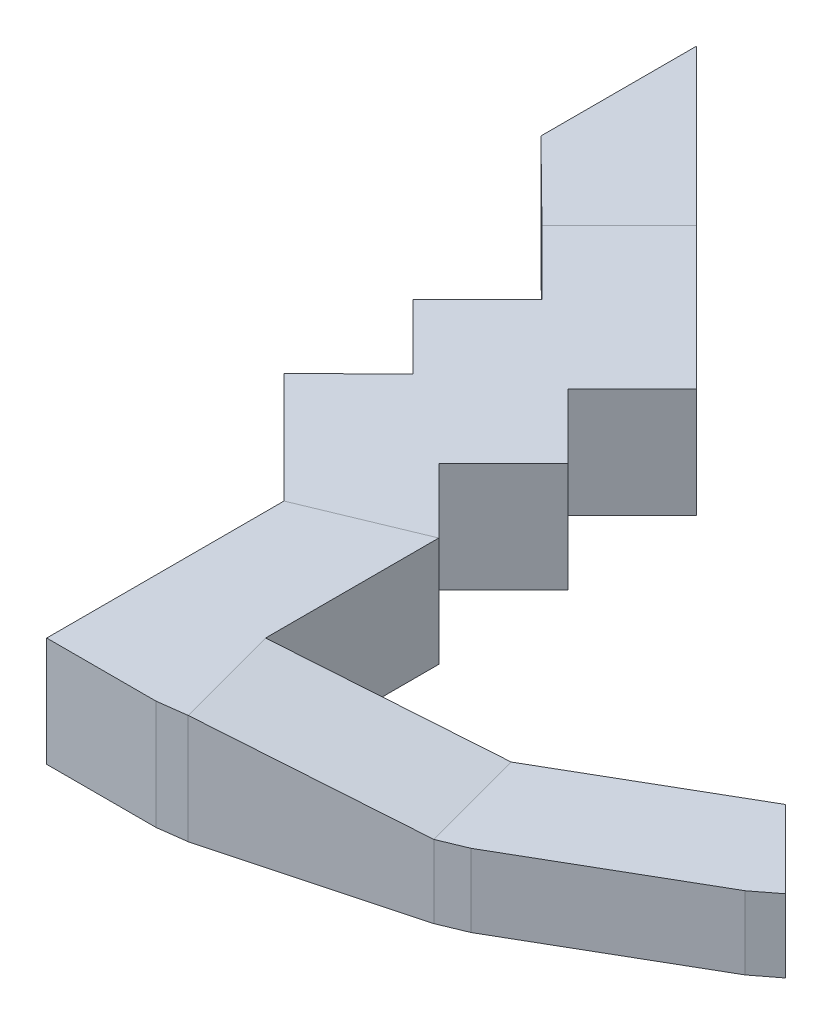
ISO-10303-21;
HEADER;
FILE_DESCRIPTION(('STEP AP214'),'2;1');
FILE_NAME('part.step','',(''),(''),'','','');
FILE_SCHEMA(('AUTOMOTIVE_DESIGN { 1 0 10303 214 1 1 1 1 }'));
ENDSEC;
DATA;
#1=APPLICATION_CONTEXT('core data for automotive mechanical design processes');
#2=APPLICATION_PROTOCOL_DEFINITION('international standard','automotive_design',2000,#1);
#3=PRODUCT_CONTEXT('',#1,'mechanical');
#4=PRODUCT('Part','Part','',(#3));
#5=PRODUCT_RELATED_PRODUCT_CATEGORY('part','',(#4));
#6=PRODUCT_DEFINITION_FORMATION('','',#4);
#7=PRODUCT_DEFINITION_CONTEXT('part definition',#1,'design');
#8=PRODUCT_DEFINITION('design','',#6,#7);
#9=PRODUCT_DEFINITION_SHAPE('','',#8);
#10=(LENGTH_UNIT() NAMED_UNIT(*) SI_UNIT(.MILLI.,.METRE.));
#11=(NAMED_UNIT(*) PLANE_ANGLE_UNIT() SI_UNIT($,.RADIAN.));
#12=(NAMED_UNIT(*) SI_UNIT($,.STERADIAN.) SOLID_ANGLE_UNIT());
#13=UNCERTAINTY_MEASURE_WITH_UNIT(LENGTH_MEASURE(1.E-05),#10,'distance_accuracy_value','');
#14=(GEOMETRIC_REPRESENTATION_CONTEXT(3) GLOBAL_UNCERTAINTY_ASSIGNED_CONTEXT((#13)) GLOBAL_UNIT_ASSIGNED_CONTEXT((#10,
#11,#12)) REPRESENTATION_CONTEXT('',''));
#15=CARTESIAN_POINT('',(0.,0.,0.));
#16=DIRECTION('',(0.,0.,1.));
#17=DIRECTION('',(1.,0.,0.));
#18=AXIS2_PLACEMENT_3D('',#15,#16,#17);
#19=CARTESIAN_POINT('',(-7369.52720002991,-600.,77.2236802050576));
#20=DIRECTION('',(0.707106781186546,0.,-0.707106781186549));
#21=DIRECTION('',(-0.707106781186549,0.,-0.707106781186546));
#22=AXIS2_PLACEMENT_3D('',#19,#20,#21);
#23=PLANE('',#22);
#24=DIRECTION('',(-0.707106781186546,0.,-0.707106781186549));
#25=VECTOR('',#24,1.);
#26=CARTESIAN_POINT('',(-7010.19169348406,-600.,436.55918675091));
#27=LINE('',#26,#25);
#28=CARTESIAN_POINT('',(-7010.19169348406,-600.,436.55918675091));
#29=VERTEX_POINT('',#28);
#30=CARTESIAN_POINT('',(-7788.00915278926,-600.,-341.258272554294));
#31=VERTEX_POINT('',#30);
#32=EDGE_CURVE('E321',#29,#31,#27,.T.);
#33=ORIENTED_EDGE('',*,*,#32,.T.);
#34=DIRECTION('',(0.,1.,0.));
#35=VECTOR('',#34,1.);
#36=CARTESIAN_POINT('',(-7788.00915278926,-600.,-341.258272554292));
#37=LINE('',#36,#35);
#38=CARTESIAN_POINT('',(-7788.00915278926,0.,-341.258272554292));
#39=VERTEX_POINT('',#38);
#40=EDGE_CURVE('E324',#31,#39,#37,.T.);
#41=ORIENTED_EDGE('',*,*,#40,.T.);
#42=DIRECTION('',(-0.707106781186549,0.,-0.707106781186546));
#43=VECTOR('',#42,1.);
#44=CARTESIAN_POINT('',(-7369.52720002991,0.,77.2236802050576));
#45=LINE('',#44,#43);
#46=CARTESIAN_POINT('',(-7010.19169348406,0.,436.55918675091));
#47=VERTEX_POINT('',#46);
#48=EDGE_CURVE('E293',#47,#39,#45,.T.);
#49=ORIENTED_EDGE('',*,*,#48,.F.);
#50=DIRECTION('',(0.,1.,0.));
#51=VECTOR('',#50,1.);
#52=CARTESIAN_POINT('',(-7010.19169348406,-600.,436.55918675091));
#53=LINE('',#52,#51);
#54=EDGE_CURVE('E257',#29,#47,#53,.T.);
#55=ORIENTED_EDGE('',*,*,#54,.F.);
#56=EDGE_LOOP('',(#33,#41,#49,#55));
#57=FACE_BOUND('',#56,.T.);
#58=ADVANCED_FACE('F38',(#57),#23,.T.);
#59=CARTESIAN_POINT('',(0.,0.,0.));
#60=DIRECTION('',(0.,1.,0.));
#61=DIRECTION('',(0.,0.,1.));
#62=AXIS2_PLACEMENT_3D('',#59,#60,#61);
#63=PLANE('',#62);
#64=DIRECTION('',(0.,0.,-1.));
#65=VECTOR('',#64,1.);
#66=CARTESIAN_POINT('',(-7010.19169348405,0.,2800.77274912401));
#67=LINE('',#66,#65);
#68=CARTESIAN_POINT('',(-7010.19169348405,0.,2800.77274912401));
#69=VERTEX_POINT('',#68);
#70=CARTESIAN_POINT('',(-7010.19169348406,0.,1850.77274912401));
#71=VERTEX_POINT('',#70);
#72=EDGE_CURVE('E239',#69,#71,#67,.T.);
#73=ORIENTED_EDGE('',*,*,#72,.T.);
#74=DIRECTION('',(-0.923622513371796,0.,0.383303343049296));
#75=VECTOR('',#74,1.);
#76=CARTESIAN_POINT('',(-374.722918828578,0.,-902.946792358019));
#77=LINE('',#76,#75);
#78=CARTESIAN_POINT('',(-7610.19169348406,0.,2099.77274912401));
#79=VERTEX_POINT('',#78);
#80=EDGE_CURVE('E422',#71,#79,#77,.T.);
#81=ORIENTED_EDGE('',*,*,#80,.T.);
#82=DIRECTION('',(0.,0.,1.));
#83=VECTOR('',#82,1.);
#84=CARTESIAN_POINT('',(-7610.19169348406,0.,3400.77274912401));
#85=LINE('',#84,#83);
#86=CARTESIAN_POINT('',(-7610.19169348406,0.,3400.77274912401));
#87=VERTEX_POINT('',#86);
#88=EDGE_CURVE('E429',#79,#87,#85,.T.);
#89=ORIENTED_EDGE('',*,*,#88,.T.);
#90=DIRECTION('',(1.,0.,0.));
#91=VECTOR('',#90,1.);
#92=CARTESIAN_POINT('',(-7010.19169348406,0.,3400.77274912401));
#93=LINE('',#92,#91);
#94=CARTESIAN_POINT('',(-7010.19169348406,0.,3400.77274912401));
#95=VERTEX_POINT('',#94);
#96=EDGE_CURVE('E427',#87,#95,#93,.T.);
#97=ORIENTED_EDGE('',*,*,#96,.T.);
#98=DIRECTION('',(0.99144486137381,0.,-0.130526192220058));
#99=VECTOR('',#98,1.);
#100=CARTESIAN_POINT('',(-7010.19169348406,0.,3400.77274912401));
#101=LINE('',#100,#99);
#102=CARTESIAN_POINT('',(-6854.90026642254,-1.196959198424E-13,3380.32824489744));
#103=VERTEX_POINT('',#102);
#104=EDGE_CURVE('E197',#95,#103,#101,.T.);
#105=ORIENTED_EDGE('',*,*,#104,.T.);
#106=DIRECTION('',(-0.258819045102514,0.,-0.96592582628907));
#107=VECTOR('',#106,1.);
#108=CARTESIAN_POINT('',(-3389.28468542171,0.,16314.1816726952));
#109=LINE('',#108,#107);
#110=EDGE_CURVE('E391',#103,#69,#109,.T.);
#111=ORIENTED_EDGE('',*,*,#110,.T.);
#112=EDGE_LOOP('',(#73,#81,#89,#97,#105,#111));
#113=FACE_BOUND('',#112,.T.);
#114=ADVANCED_FACE('F423',(#113),#63,.T.);
#115=DIRECTION('',(-0.711924819814183,0.,-0.702255687718186));
#116=VECTOR('',#115,1.);
#117=CARTESIAN_POINT('',(-4091.48873489222,0.,4147.82312383182));
#118=LINE('',#117,#116);
#119=CARTESIAN_POINT('',(-8212.27322150119,0.,83.0057961576385));
#120=VERTEX_POINT('',#119);
#121=CARTESIAN_POINT('',(-8639.44310705767,0.,-338.362406502111));
#122=VERTEX_POINT('',#121);
#123=EDGE_CURVE('E249',#120,#122,#118,.T.);
#124=ORIENTED_EDGE('',*,*,#123,.F.);
#125=DIRECTION('',(0.707106781186545,0.,-0.70710678118655));
#126=VECTOR('',#125,1.);
#127=CARTESIAN_POINT('',(-4064.6337126718,0.,-4064.63371267177));
#128=LINE('',#127,#126);
#129=EDGE_CURVE('E411',#120,#39,#128,.T.);
#130=ORIENTED_EDGE('',*,*,#129,.T.);
#131=CARTESIAN_POINT('',(-8639.44310705767,0.,-1192.6922268227));
#132=VERTEX_POINT('',#131);
#133=EDGE_CURVE('E297',#39,#132,#45,.T.);
#134=ORIENTED_EDGE('',*,*,#133,.T.);
#135=DIRECTION('',(0.,0.,-1.));
#136=VECTOR('',#135,1.);
#137=CARTESIAN_POINT('',(-8639.44310705767,0.,0.));
#138=LINE('',#137,#136);
#139=EDGE_CURVE('E264',#122,#132,#138,.T.);
#140=ORIENTED_EDGE('',*,*,#139,.F.);
#141=EDGE_LOOP('',(#124,#130,#134,#140));
#142=FACE_BOUND('',#141,.T.);
#143=ADVANCED_FACE('F471',(#142),#63,.T.);
#144=ORIENTED_EDGE('',*,*,#80,.F.);
#145=DIRECTION('',(-0.707106781186548,0.,-0.707106781186547));
#146=VECTOR('',#145,1.);
#147=CARTESIAN_POINT('',(-7010.19169348406,0.,1850.77274912401));
#148=LINE('',#147,#146);
#149=CARTESIAN_POINT('',(-7363.74508407733,0.,1497.21935853073));
#150=VERTEX_POINT('',#149);
#151=EDGE_CURVE('E306',#71,#150,#148,.T.);
#152=ORIENTED_EDGE('',*,*,#151,.T.);
#153=DIRECTION('',(0.707106781186547,0.,-0.707106781186548));
#154=VECTOR('',#153,1.);
#155=CARTESIAN_POINT('',(-7363.74508407733,0.,1497.21935853073));
#156=LINE('',#155,#154);
#157=CARTESIAN_POINT('',(-7010.19169348406,0.,1143.66596793746));
#158=VERTEX_POINT('',#157);
#159=EDGE_CURVE('E303',#150,#158,#156,.T.);
#160=ORIENTED_EDGE('',*,*,#159,.T.);
#161=DIRECTION('',(-0.707106781186548,0.,-0.707106781186547));
#162=VECTOR('',#161,1.);
#163=CARTESIAN_POINT('',(-7010.19169348406,0.,1143.66596793746));
#164=LINE('',#163,#162);
#165=CARTESIAN_POINT('',(-7363.74508407733,0.,790.112577344184));
#166=VERTEX_POINT('',#165);
#167=EDGE_CURVE('E300',#158,#166,#164,.T.);
#168=ORIENTED_EDGE('',*,*,#167,.T.);
#169=DIRECTION('',(0.707106781186548,0.,-0.707106781186547));
#170=VECTOR('',#169,1.);
#171=CARTESIAN_POINT('',(-7363.74508407733,0.,790.112577344184));
#172=LINE('',#171,#170);
#173=EDGE_CURVE('E296',#166,#47,#172,.T.);
#174=ORIENTED_EDGE('',*,*,#173,.T.);
#175=ORIENTED_EDGE('',*,*,#48,.T.);
#176=ORIENTED_EDGE('',*,*,#129,.F.);
#177=DIRECTION('',(0.707106781186548,0.,0.707106781186547));
#178=VECTOR('',#177,1.);
#179=CARTESIAN_POINT('',(-7858.71983090791,0.,436.55918675091));
#180=LINE('',#179,#178);
#181=CARTESIAN_POINT('',(-7858.71983090791,0.,436.55918675091));
#182=VERTEX_POINT('',#181);
#183=EDGE_CURVE('E290',#120,#182,#180,.T.);
#184=ORIENTED_EDGE('',*,*,#183,.T.);
#185=DIRECTION('',(-0.707106781186546,0.,0.707106781186549));
#186=VECTOR('',#185,1.);
#187=CARTESIAN_POINT('',(-7858.71983090791,0.,436.55918675091));
#188=LINE('',#187,#186);
#189=CARTESIAN_POINT('',(-8212.27322150119,0.,790.112577344185));
#190=VERTEX_POINT('',#189);
#191=EDGE_CURVE('E287',#182,#190,#188,.T.);
#192=ORIENTED_EDGE('',*,*,#191,.T.);
#193=DIRECTION('',(0.707106781186548,0.,0.707106781186547));
#194=VECTOR('',#193,1.);
#195=CARTESIAN_POINT('',(-7858.71983090791,0.,1143.66596793746));
#196=LINE('',#195,#194);
#197=CARTESIAN_POINT('',(-7858.71983090791,0.,1143.66596793746));
#198=VERTEX_POINT('',#197);
#199=EDGE_CURVE('E284',#190,#198,#196,.T.);
#200=ORIENTED_EDGE('',*,*,#199,.T.);
#201=DIRECTION('',(-0.714982573332399,0.,0.699142274384106));
#202=VECTOR('',#201,1.);
#203=CARTESIAN_POINT('',(-8216.47211874121,0.,1493.49232386685));
#204=LINE('',#203,#202);
#205=CARTESIAN_POINT('',(-8216.47211874121,0.,1493.49232386685));
#206=VERTEX_POINT('',#205);
#207=EDGE_CURVE('E281',#198,#206,#204,.T.);
#208=ORIENTED_EDGE('',*,*,#207,.T.);
#209=DIRECTION('',(0.707106781186547,0.,0.707106781186548));
#210=VECTOR('',#209,1.);
#211=CARTESIAN_POINT('',(-7610.19169348406,0.,2099.77274912401));
#212=LINE('',#211,#210);
#213=EDGE_CURVE('E278',#206,#79,#212,.T.);
#214=ORIENTED_EDGE('',*,*,#213,.T.);
#215=EDGE_LOOP('',(#144,#152,#160,#168,#174,#175,#176,#184,#192,#200,#208,#214));
#216=FACE_BOUND('',#215,.T.);
#217=ADVANCED_FACE('F488',(#216),#63,.T.);
#218=CARTESIAN_POINT('',(-6854.90026642254,-600.,3380.32824489745));
#219=DIRECTION('',(0.258819045102514,0.,0.96592582628907));
#220=DIRECTION('',(0.96592582628907,0.,-0.258819045102514));
#221=AXIS2_PLACEMENT_3D('',#218,#219,#220);
#222=PLANE('',#221);
#223=DIRECTION('',(0.,1.,0.));
#224=VECTOR('',#223,1.);
#225=CARTESIAN_POINT('',(-5792.38185750457,-600.,3095.62729528468));
#226=LINE('',#225,#224);
#227=CARTESIAN_POINT('',(-5792.38185750457,-600.,3095.62729528468));
#228=VERTEX_POINT('',#227);
#229=CARTESIAN_POINT('',(-5792.38185750457,-200.,3095.62729528468));
#230=VERTEX_POINT('',#229);
#231=EDGE_CURVE('E234',#228,#230,#226,.T.);
#232=ORIENTED_EDGE('',*,*,#231,.T.);
#233=DIRECTION('',(-0.950345355874206,0.178885438199983,0.254644270637155));
#234=VECTOR('',#233,1.);
#235=CARTESIAN_POINT('',(-6752.89849916642,-19.2000000000003,3352.99695373462));
#236=LINE('',#235,#234);
#237=EDGE_CURVE('E208',#230,#103,#236,.T.);
#238=ORIENTED_EDGE('',*,*,#237,.T.);
#239=DIRECTION('',(0.,1.,0.));
#240=VECTOR('',#239,1.);
#241=CARTESIAN_POINT('',(-6854.90026642254,-600.,3380.32824489745));
#242=LINE('',#241,#240);
#243=CARTESIAN_POINT('',(-6854.90026642254,-600.,3380.32824489745));
#244=VERTEX_POINT('',#243);
#245=EDGE_CURVE('E212',#244,#103,#242,.T.);
#246=ORIENTED_EDGE('',*,*,#245,.F.);
#247=DIRECTION('',(0.96592582628907,0.,-0.258819045102514));
#248=VECTOR('',#247,1.);
#249=CARTESIAN_POINT('',(-6854.90026642254,-600.,3380.32824489745));
#250=LINE('',#249,#248);
#251=EDGE_CURVE('E204',#244,#228,#250,.T.);
#252=ORIENTED_EDGE('',*,*,#251,.T.);
#253=EDGE_LOOP('',(#232,#238,#246,#252));
#254=FACE_BOUND('',#253,.T.);
#255=ADVANCED_FACE('F378',(#254),#222,.T.);
#256=CARTESIAN_POINT('',(-7010.19169348406,-600.,2800.772749124));
#257=DIRECTION('',(-0.258819045102515,0.,-0.96592582628907));
#258=DIRECTION('',(-0.96592582628907,0.,0.258819045102515));
#259=AXIS2_PLACEMENT_3D('',#256,#257,#258);
#260=PLANE('',#259);
#261=DIRECTION('',(0.,1.,0.));
#262=VECTOR('',#261,1.);
#263=CARTESIAN_POINT('',(-7010.19169348406,-600.,2800.772749124));
#264=LINE('',#263,#262);
#265=CARTESIAN_POINT('',(-7010.19169348405,-600.,2800.772749124));
#266=VERTEX_POINT('',#265);
#267=EDGE_CURVE('E207',#266,#69,#264,.T.);
#268=ORIENTED_EDGE('',*,*,#267,.T.);
#269=DIRECTION('',(0.950345355874206,-0.178885438199983,-0.254644270637155));
#270=VECTOR('',#269,1.);
#271=CARTESIAN_POINT('',(-6908.18992622793,-19.1999999999992,2773.44145796118));
#272=LINE('',#271,#270);
#273=CARTESIAN_POINT('',(-5947.67328456608,-200.,2516.07179951121));
#274=VERTEX_POINT('',#273);
#275=EDGE_CURVE('E406',#69,#274,#272,.T.);
#276=ORIENTED_EDGE('',*,*,#275,.T.);
#277=DIRECTION('',(0.,1.,0.));
#278=VECTOR('',#277,1.);
#279=CARTESIAN_POINT('',(-5947.67328456608,-600.,2516.07179951124));
#280=LINE('',#279,#278);
#281=CARTESIAN_POINT('',(-5947.67328456608,-600.,2516.07179951124));
#282=VERTEX_POINT('',#281);
#283=EDGE_CURVE('E203',#282,#274,#280,.T.);
#284=ORIENTED_EDGE('',*,*,#283,.F.);
#285=DIRECTION('',(-0.96592582628907,0.,0.258819045102515));
#286=VECTOR('',#285,1.);
#287=CARTESIAN_POINT('',(-7010.19169348406,-600.,2800.772749124));
#288=LINE('',#287,#286);
#289=EDGE_CURVE('E177',#282,#266,#288,.T.);
#290=ORIENTED_EDGE('',*,*,#289,.T.);
#291=EDGE_LOOP('',(#268,#276,#284,#290));
#292=FACE_BOUND('',#291,.T.);
#293=ADVANCED_FACE('F413',(#292),#260,.T.);
#294=CARTESIAN_POINT('',(-4695.04534040316,-600.,2485.68704178188));
#295=DIRECTION('',(0.60876142900875,0.,0.793353340291213));
#296=DIRECTION('',(0.793353340291213,0.,-0.60876142900875));
#297=AXIS2_PLACEMENT_3D('',#294,#295,#296);
#298=PLANE('',#297);
#299=DIRECTION('',(0.,1.,0.));
#300=VECTOR('',#299,1.);
#301=CARTESIAN_POINT('',(-4570.78127169127,-600.,2390.33586822317));
#302=LINE('',#301,#300);
#303=CARTESIAN_POINT('',(-4570.78127169127,-600.,2390.33586822317));
#304=VERTEX_POINT('',#303);
#305=CARTESIAN_POINT('',(-4570.78127169127,-200.,2390.33586822317));
#306=VERTEX_POINT('',#305);
#307=EDGE_CURVE('E170',#304,#306,#302,.T.);
#308=ORIENTED_EDGE('',*,*,#307,.T.);
#309=DIRECTION('',(0.793353340291216,0.,-0.608761429008747));
#310=VECTOR('',#309,1.);
#311=CARTESIAN_POINT('',(-4695.04534040316,-200.,2485.68704178188));
#312=LINE('',#311,#310);
#313=CARTESIAN_POINT('',(-4695.04534040316,-200.,2485.68704178188));
#314=VERTEX_POINT('',#313);
#315=EDGE_CURVE('E229',#314,#306,#312,.T.);
#316=ORIENTED_EDGE('',*,*,#315,.F.);
#317=DIRECTION('',(0.,1.,0.));
#318=VECTOR('',#317,1.);
#319=CARTESIAN_POINT('',(-4695.04534040316,-600.,2485.68704178188));
#320=LINE('',#319,#318);
#321=CARTESIAN_POINT('',(-4695.04534040316,-600.,2485.68704178188));
#322=VERTEX_POINT('',#321);
#323=EDGE_CURVE('E191',#322,#314,#320,.T.);
#324=ORIENTED_EDGE('',*,*,#323,.F.);
#325=DIRECTION('',(0.793353340291213,0.,-0.60876142900875));
#326=VECTOR('',#325,1.);
#327=CARTESIAN_POINT('',(-4695.04534040316,-600.,2485.68704178188));
#328=LINE('',#327,#326);
#329=EDGE_CURVE('E176',#322,#304,#328,.T.);
#330=ORIENTED_EDGE('',*,*,#329,.T.);
#331=EDGE_LOOP('',(#308,#316,#324,#330));
#332=FACE_BOUND('',#331,.T.);
#333=ADVANCED_FACE('F189',(#332),#298,.T.);
#334=CARTESIAN_POINT('',(-5647.67328456608,-600.,3035.6870417819));
#335=DIRECTION('',(0.5,0.,0.866025403784439));
#336=DIRECTION('',(0.866025403784439,0.,-0.5));
#337=AXIS2_PLACEMENT_3D('',#334,#335,#336);
#338=PLANE('',#337);
#339=ORIENTED_EDGE('',*,*,#323,.T.);
#340=DIRECTION('',(0.866025403784439,0.,-0.5));
#341=VECTOR('',#340,1.);
#342=CARTESIAN_POINT('',(-5647.67328456608,-200.,3035.6870417819));
#343=LINE('',#342,#341);
#344=CARTESIAN_POINT('',(-5647.67328456608,-200.,3035.6870417819));
#345=VERTEX_POINT('',#344);
#346=EDGE_CURVE('E216',#345,#314,#343,.T.);
#347=ORIENTED_EDGE('',*,*,#346,.F.);
#348=DIRECTION('',(0.,1.,0.));
#349=VECTOR('',#348,1.);
#350=CARTESIAN_POINT('',(-5647.67328456608,-600.,3035.6870417819));
#351=LINE('',#350,#349);
#352=CARTESIAN_POINT('',(-5647.67328456608,-600.,3035.6870417819));
#353=VERTEX_POINT('',#352);
#354=EDGE_CURVE('E199',#353,#345,#351,.T.);
#355=ORIENTED_EDGE('',*,*,#354,.F.);
#356=DIRECTION('',(0.866025403784439,0.,-0.5));
#357=VECTOR('',#356,1.);
#358=CARTESIAN_POINT('',(-5647.67328456608,-600.,3035.6870417819));
#359=LINE('',#358,#357);
#360=EDGE_CURVE('E193',#353,#322,#359,.T.);
#361=ORIENTED_EDGE('',*,*,#360,.T.);
#362=EDGE_LOOP('',(#339,#347,#355,#361));
#363=FACE_BOUND('',#362,.T.);
#364=ADVANCED_FACE('F372',(#363),#338,.T.);
#365=CARTESIAN_POINT('',(-5792.38185750457,-600.,3095.62729528468));
#366=DIRECTION('',(0.38268343236509,0.,0.923879532511286));
#367=DIRECTION('',(0.923879532511287,0.,-0.382683432365091));
#368=AXIS2_PLACEMENT_3D('',#365,#366,#367);
#369=PLANE('',#368);
#370=ORIENTED_EDGE('',*,*,#354,.T.);
#371=DIRECTION('',(0.923879532511287,0.,-0.38268343236509));
#372=VECTOR('',#371,1.);
#373=CARTESIAN_POINT('',(-5792.38185750457,-200.,3095.62729528468));
#374=LINE('',#373,#372);
#375=EDGE_CURVE('E220',#230,#345,#374,.T.);
#376=ORIENTED_EDGE('',*,*,#375,.F.);
#377=ORIENTED_EDGE('',*,*,#231,.F.);
#378=DIRECTION('',(0.923879532511286,0.,-0.38268343236509));
#379=VECTOR('',#378,1.);
#380=CARTESIAN_POINT('',(-5792.38185750457,-600.,3095.62729528468));
#381=LINE('',#380,#379);
#382=EDGE_CURVE('E200',#228,#353,#381,.T.);
#383=ORIENTED_EDGE('',*,*,#382,.T.);
#384=EDGE_LOOP('',(#370,#376,#377,#383));
#385=FACE_BOUND('',#384,.T.);
#386=ADVANCED_FACE('F364',(#385),#369,.T.);
#387=CARTESIAN_POINT('',(-5947.67328456608,-600.,2516.07179951124));
#388=DIRECTION('',(-0.5,0.,-0.866025403784439));
#389=DIRECTION('',(-0.866025403784439,0.,0.5));
#390=AXIS2_PLACEMENT_3D('',#387,#388,#389);
#391=PLANE('',#390);
#392=ORIENTED_EDGE('',*,*,#283,.T.);
#393=DIRECTION('',(-0.866025403784441,0.,0.499999999999996));
#394=VECTOR('',#393,1.);
#395=CARTESIAN_POINT('',(-4995.04534040319,-200.,1966.07179951124));
#396=LINE('',#395,#394);
#397=CARTESIAN_POINT('',(-4995.04534040319,-200.,1966.07179951124));
#398=VERTEX_POINT('',#397);
#399=EDGE_CURVE('E226',#398,#274,#396,.T.);
#400=ORIENTED_EDGE('',*,*,#399,.F.);
#401=DIRECTION('',(0.,1.,0.));
#402=VECTOR('',#401,1.);
#403=CARTESIAN_POINT('',(-4995.04534040318,-600.,1966.07179951123));
#404=LINE('',#403,#402);
#405=CARTESIAN_POINT('',(-4995.04534040318,-600.,1966.07179951123));
#406=VERTEX_POINT('',#405);
#407=EDGE_CURVE('E11',#406,#398,#404,.T.);
#408=ORIENTED_EDGE('',*,*,#407,.F.);
#409=DIRECTION('',(-0.866025403784439,0.,0.5));
#410=VECTOR('',#409,1.);
#411=CARTESIAN_POINT('',(-5947.67328456608,-600.,2516.07179951124));
#412=LINE('',#411,#410);
#413=EDGE_CURVE('E187',#406,#282,#412,.T.);
#414=ORIENTED_EDGE('',*,*,#413,.T.);
#415=EDGE_LOOP('',(#392,#400,#408,#414));
#416=FACE_BOUND('',#415,.T.);
#417=ADVANCED_FACE('F396',(#416),#391,.T.);
#418=CARTESIAN_POINT('',(-7010.19169348406,-600.,3400.77274912401));
#419=DIRECTION('',(0.130526192220058,0.,0.99144486137381));
#420=DIRECTION('',(0.99144486137381,0.,-0.130526192220058));
#421=AXIS2_PLACEMENT_3D('',#418,#419,#420);
#422=PLANE('',#421);
#423=ORIENTED_EDGE('',*,*,#104,.F.);
#424=DIRECTION('',(0.,1.,0.));
#425=VECTOR('',#424,1.);
#426=CARTESIAN_POINT('',(-7010.19169348406,-600.,3400.77274912401));
#427=LINE('',#426,#425);
#428=CARTESIAN_POINT('',(-7010.19169348406,-600.,3400.77274912401));
#429=VERTEX_POINT('',#428);
#430=EDGE_CURVE('E355',#429,#95,#427,.T.);
#431=ORIENTED_EDGE('',*,*,#430,.F.);
#432=DIRECTION('',(0.99144486137381,0.,-0.130526192220058));
#433=VECTOR('',#432,1.);
#434=CARTESIAN_POINT('',(-7010.19169348406,-600.,3400.77274912401));
#435=LINE('',#434,#433);
#436=EDGE_CURVE('E209',#429,#244,#435,.T.);
#437=ORIENTED_EDGE('',*,*,#436,.T.);
#438=ORIENTED_EDGE('',*,*,#245,.T.);
#439=EDGE_LOOP('',(#423,#431,#437,#438));
#440=FACE_BOUND('',#439,.T.);
#441=ADVANCED_FACE('F450',(#440),#422,.T.);
#442=CARTESIAN_POINT('',(0.,-600.,0.));
#443=DIRECTION('',(0.,1.,0.));
#444=DIRECTION('',(0.,0.,1.));
#445=AXIS2_PLACEMENT_3D('',#442,#443,#444);
#446=PLANE('',#445);
#447=ORIENTED_EDGE('',*,*,#413,.F.);
#448=DIRECTION('',(-0.707106781186522,0.,-0.707106781186573));
#449=VECTOR('',#448,1.);
#450=CARTESIAN_POINT('',(-4570.78127169127,-600.,2390.33586822317));
#451=LINE('',#450,#449);
#452=EDGE_CURVE('E42',#304,#406,#451,.T.);
#453=ORIENTED_EDGE('',*,*,#452,.F.);
#454=ORIENTED_EDGE('',*,*,#329,.F.);
#455=ORIENTED_EDGE('',*,*,#360,.F.);
#456=ORIENTED_EDGE('',*,*,#382,.F.);
#457=ORIENTED_EDGE('',*,*,#251,.F.);
#458=ORIENTED_EDGE('',*,*,#436,.F.);
#459=DIRECTION('',(1.,0.,0.));
#460=VECTOR('',#459,1.);
#461=CARTESIAN_POINT('',(-7010.19169348406,-600.,3400.77274912401));
#462=LINE('',#461,#460);
#463=CARTESIAN_POINT('',(-7610.19169348406,-600.,3400.77274912401));
#464=VERTEX_POINT('',#463);
#465=EDGE_CURVE('E435',#464,#429,#462,.T.);
#466=ORIENTED_EDGE('',*,*,#465,.F.);
#467=DIRECTION('',(0.,0.,1.));
#468=VECTOR('',#467,1.);
#469=CARTESIAN_POINT('',(-7610.19169348406,-600.,3400.77274912401));
#470=LINE('',#469,#468);
#471=CARTESIAN_POINT('',(-7610.19169348406,-600.,2099.77274912401));
#472=VERTEX_POINT('',#471);
#473=EDGE_CURVE('E245',#472,#464,#470,.T.);
#474=ORIENTED_EDGE('',*,*,#473,.F.);
#475=DIRECTION('',(0.707106781186547,0.,0.707106781186548));
#476=VECTOR('',#475,1.);
#477=CARTESIAN_POINT('',(-7610.19169348406,-600.,2099.77274912401));
#478=LINE('',#477,#476);
#479=CARTESIAN_POINT('',(-8216.47211874121,-600.,1493.49232386685));
#480=VERTEX_POINT('',#479);
#481=EDGE_CURVE('E309',#480,#472,#478,.T.);
#482=ORIENTED_EDGE('',*,*,#481,.F.);
#483=DIRECTION('',(-0.714982573332399,0.,0.699142274384106));
#484=VECTOR('',#483,1.);
#485=CARTESIAN_POINT('',(-8216.47211874121,-600.,1493.49232386685));
#486=LINE('',#485,#484);
#487=CARTESIAN_POINT('',(-7858.71983090791,-600.,1143.66596793746));
#488=VERTEX_POINT('',#487);
#489=EDGE_CURVE('E277',#488,#480,#486,.T.);
#490=ORIENTED_EDGE('',*,*,#489,.F.);
#491=DIRECTION('',(0.707106781186548,0.,0.707106781186547));
#492=VECTOR('',#491,1.);
#493=CARTESIAN_POINT('',(-7858.71983090791,-600.,1143.66596793746));
#494=LINE('',#493,#492);
#495=CARTESIAN_POINT('',(-8212.27322150119,-600.,790.112577344185));
#496=VERTEX_POINT('',#495);
#497=EDGE_CURVE('E274',#496,#488,#494,.T.);
#498=ORIENTED_EDGE('',*,*,#497,.F.);
#499=DIRECTION('',(-0.707106781186546,0.,0.707106781186549));
#500=VECTOR('',#499,1.);
#501=CARTESIAN_POINT('',(-7858.71983090791,-600.,436.55918675091));
#502=LINE('',#501,#500);
#503=CARTESIAN_POINT('',(-7858.71983090791,-600.,436.55918675091));
#504=VERTEX_POINT('',#503);
#505=EDGE_CURVE('E271',#504,#496,#502,.T.);
#506=ORIENTED_EDGE('',*,*,#505,.F.);
#507=DIRECTION('',(0.707106781186548,0.,0.707106781186547));
#508=VECTOR('',#507,1.);
#509=CARTESIAN_POINT('',(-7858.71983090791,-600.,436.55918675091));
#510=LINE('',#509,#508);
#511=CARTESIAN_POINT('',(-8212.27322150119,-600.,83.0057961576385));
#512=VERTEX_POINT('',#511);
#513=EDGE_CURVE('E268',#512,#504,#510,.T.);
#514=ORIENTED_EDGE('',*,*,#513,.F.);
#515=DIRECTION('',(-0.711924819814183,0.,-0.702255687718186));
#516=VECTOR('',#515,1.);
#517=CARTESIAN_POINT('',(-4091.48873489222,-600.,4147.82312383182));
#518=LINE('',#517,#516);
#519=CARTESIAN_POINT('',(-8639.44310705767,-600.,-338.362406502111));
#520=VERTEX_POINT('',#519);
#521=EDGE_CURVE('E343',#512,#520,#518,.T.);
#522=ORIENTED_EDGE('',*,*,#521,.T.);
#523=DIRECTION('',(0.,0.,-1.));
#524=VECTOR('',#523,1.);
#525=CARTESIAN_POINT('',(-8639.44310705767,-600.,0.));
#526=LINE('',#525,#524);
#527=CARTESIAN_POINT('',(-8639.44310705767,-600.,-1192.6922268227));
#528=VERTEX_POINT('',#527);
#529=EDGE_CURVE('E231',#520,#528,#526,.T.);
#530=ORIENTED_EDGE('',*,*,#529,.T.);
#531=EDGE_CURVE('E267',#31,#528,#27,.T.);
#532=ORIENTED_EDGE('',*,*,#531,.F.);
#533=ORIENTED_EDGE('',*,*,#32,.F.);
#534=DIRECTION('',(0.707106781186548,0.,-0.707106781186547));
#535=VECTOR('',#534,1.);
#536=CARTESIAN_POINT('',(-7363.74508407733,-600.,790.112577344184));
#537=LINE('',#536,#535);
#538=CARTESIAN_POINT('',(-7363.74508407733,-600.,790.112577344184));
#539=VERTEX_POINT('',#538);
#540=EDGE_CURVE('E260',#539,#29,#537,.T.);
#541=ORIENTED_EDGE('',*,*,#540,.F.);
#542=DIRECTION('',(-0.707106781186548,0.,-0.707106781186547));
#543=VECTOR('',#542,1.);
#544=CARTESIAN_POINT('',(-7010.19169348406,-600.,1143.66596793746));
#545=LINE('',#544,#543);
#546=CARTESIAN_POINT('',(-7010.19169348406,-600.,1143.66596793746));
#547=VERTEX_POINT('',#546);
#548=EDGE_CURVE('E256',#547,#539,#545,.T.);
#549=ORIENTED_EDGE('',*,*,#548,.F.);
#550=DIRECTION('',(0.707106781186547,0.,-0.707106781186548));
#551=VECTOR('',#550,1.);
#552=CARTESIAN_POINT('',(-7363.74508407733,-600.,1497.21935853073));
#553=LINE('',#552,#551);
#554=CARTESIAN_POINT('',(-7363.74508407733,-600.,1497.21935853073));
#555=VERTEX_POINT('',#554);
#556=EDGE_CURVE('E253',#555,#547,#553,.T.);
#557=ORIENTED_EDGE('',*,*,#556,.F.);
#558=DIRECTION('',(-0.707106781186548,0.,-0.707106781186547));
#559=VECTOR('',#558,1.);
#560=CARTESIAN_POINT('',(-7010.19169348406,-600.,1850.77274912401));
#561=LINE('',#560,#559);
#562=CARTESIAN_POINT('',(-7010.19169348406,-600.,1850.77274912401));
#563=VERTEX_POINT('',#562);
#564=EDGE_CURVE('E250',#563,#555,#561,.T.);
#565=ORIENTED_EDGE('',*,*,#564,.F.);
#566=DIRECTION('',(0.,0.,-1.));
#567=VECTOR('',#566,1.);
#568=CARTESIAN_POINT('',(-7010.19169348406,-600.,3400.77274912401));
#569=LINE('',#568,#567);
#570=EDGE_CURVE('E219',#266,#563,#569,.T.);
#571=ORIENTED_EDGE('',*,*,#570,.F.);
#572=ORIENTED_EDGE('',*,*,#289,.F.);
#573=EDGE_LOOP('',(#447,#453,#454,#455,#456,#457,#458,#466,#474,#482,#490,#498,#506,#514,#522,
#530,#532,#533,#541,#549,#557,#565,#571,#572));
#574=FACE_BOUND('',#573,.T.);
#575=ADVANCED_FACE('F40',(#574),#446,.F.);
#576=CARTESIAN_POINT('',(0.,-200.,0.));
#577=DIRECTION('',(0.,1.,0.));
#578=DIRECTION('',(0.,0.,1.));
#579=AXIS2_PLACEMENT_3D('',#576,#577,#578);
#580=PLANE('',#579);
#581=ORIENTED_EDGE('',*,*,#315,.T.);
#582=DIRECTION('',(0.707106781186548,0.,0.707106781186547));
#583=VECTOR('',#582,1.);
#584=CARTESIAN_POINT('',(-13238.7276409761,-200.,-6277.61050106171));
#585=LINE('',#584,#583);
#586=EDGE_CURVE('E167',#398,#306,#585,.T.);
#587=ORIENTED_EDGE('',*,*,#586,.F.);
#588=ORIENTED_EDGE('',*,*,#399,.T.);
#589=DIRECTION('',(0.258819045102525,0.,0.965925826289067));
#590=VECTOR('',#589,1.);
#591=CARTESIAN_POINT('',(-5947.67328456608,-200.,2516.07179951124));
#592=LINE('',#591,#590);
#593=EDGE_CURVE('E223',#274,#230,#592,.T.);
#594=ORIENTED_EDGE('',*,*,#593,.T.);
#595=ORIENTED_EDGE('',*,*,#375,.T.);
#596=ORIENTED_EDGE('',*,*,#346,.T.);
#597=EDGE_LOOP('',(#581,#587,#588,#594,#595,#596));
#598=FACE_BOUND('',#597,.T.);
#599=ADVANCED_FACE('F392',(#598),#580,.T.);
#600=CARTESIAN_POINT('',(-2326.76627650373,-200.,16029.4807230825));
#601=DIRECTION('',(0.172790064704401,0.983869910099907,-0.0462989582976645));
#602=DIRECTION('',(-0.984926117053838,0.172975558808894,0.));
#603=AXIS2_PLACEMENT_3D('',#600,#601,#602);
#604=PLANE('',#603);
#605=ORIENTED_EDGE('',*,*,#237,.F.);
#606=ORIENTED_EDGE('',*,*,#593,.F.);
#607=ORIENTED_EDGE('',*,*,#275,.F.);
#608=ORIENTED_EDGE('',*,*,#110,.F.);
#609=EDGE_LOOP('',(#605,#606,#607,#608));
#610=FACE_BOUND('',#609,.T.);
#611=ADVANCED_FACE('F387',(#610),#604,.T.);
#612=CARTESIAN_POINT('',(-7010.19169348405,-600.,2800.77274912401));
#613=DIRECTION('',(1.,0.,0.));
#614=DIRECTION('',(0.,0.,-1.));
#615=AXIS2_PLACEMENT_3D('',#612,#613,#614);
#616=PLANE('',#615);
#617=ORIENTED_EDGE('',*,*,#267,.F.);
#618=ORIENTED_EDGE('',*,*,#570,.T.);
#619=DIRECTION('',(0.,1.,0.));
#620=VECTOR('',#619,1.);
#621=CARTESIAN_POINT('',(-7010.19169348406,-600.,1850.77274912401));
#622=LINE('',#621,#620);
#623=EDGE_CURVE('E238',#563,#71,#622,.T.);
#624=ORIENTED_EDGE('',*,*,#623,.T.);
#625=ORIENTED_EDGE('',*,*,#72,.F.);
#626=EDGE_LOOP('',(#617,#618,#624,#625));
#627=FACE_BOUND('',#626,.T.);
#628=ADVANCED_FACE('F419',(#627),#616,.T.);
#629=CARTESIAN_POINT('',(-7010.19169348406,-600.,3400.77274912401));
#630=DIRECTION('',(0.,0.,1.));
#631=DIRECTION('',(1.,0.,0.));
#632=AXIS2_PLACEMENT_3D('',#629,#630,#631);
#633=PLANE('',#632);
#634=ORIENTED_EDGE('',*,*,#96,.F.);
#635=DIRECTION('',(0.,1.,0.));
#636=VECTOR('',#635,1.);
#637=CARTESIAN_POINT('',(-7610.19169348406,-600.,3400.77274912401));
#638=LINE('',#637,#636);
#639=EDGE_CURVE('E312',#464,#87,#638,.T.);
#640=ORIENTED_EDGE('',*,*,#639,.F.);
#641=ORIENTED_EDGE('',*,*,#465,.T.);
#642=ORIENTED_EDGE('',*,*,#430,.T.);
#643=EDGE_LOOP('',(#634,#640,#641,#642));
#644=FACE_BOUND('',#643,.T.);
#645=ADVANCED_FACE('F449',(#644),#633,.T.);
#646=CARTESIAN_POINT('',(-7610.19169348406,-600.,3400.77274912401));
#647=DIRECTION('',(-1.,0.,0.));
#648=DIRECTION('',(0.,0.,1.));
#649=AXIS2_PLACEMENT_3D('',#646,#647,#648);
#650=PLANE('',#649);
#651=ORIENTED_EDGE('',*,*,#88,.F.);
#652=DIRECTION('',(0.,1.,0.));
#653=VECTOR('',#652,1.);
#654=CARTESIAN_POINT('',(-7610.19169348406,-600.,2099.77274912401));
#655=LINE('',#654,#653);
#656=EDGE_CURVE('E311',#472,#79,#655,.T.);
#657=ORIENTED_EDGE('',*,*,#656,.F.);
#658=ORIENTED_EDGE('',*,*,#473,.T.);
#659=ORIENTED_EDGE('',*,*,#639,.T.);
#660=EDGE_LOOP('',(#651,#657,#658,#659));
#661=FACE_BOUND('',#660,.T.);
#662=ADVANCED_FACE('F448',(#661),#650,.T.);
#663=CARTESIAN_POINT('',(-7610.19169348406,-600.,2099.77274912401));
#664=DIRECTION('',(-0.707106781186548,0.,0.707106781186547));
#665=DIRECTION('',(0.707106781186547,0.,0.707106781186548));
#666=AXIS2_PLACEMENT_3D('',#663,#664,#665);
#667=PLANE('',#666);
#668=ORIENTED_EDGE('',*,*,#213,.F.);
#669=DIRECTION('',(0.,1.,0.));
#670=VECTOR('',#669,1.);
#671=CARTESIAN_POINT('',(-8216.47211874121,-600.,1493.49232386685));
#672=LINE('',#671,#670);
#673=EDGE_CURVE('E275',#480,#206,#672,.T.);
#674=ORIENTED_EDGE('',*,*,#673,.F.);
#675=ORIENTED_EDGE('',*,*,#481,.T.);
#676=ORIENTED_EDGE('',*,*,#656,.T.);
#677=EDGE_LOOP('',(#668,#674,#675,#676));
#678=FACE_BOUND('',#677,.T.);
#679=ADVANCED_FACE('F443',(#678),#667,.T.);
#680=CARTESIAN_POINT('',(-8216.47211874121,-600.,1493.49232386685));
#681=DIRECTION('',(-0.699142274384106,0.,-0.714982573332399));
#682=DIRECTION('',(-0.714982573332399,0.,0.699142274384106));
#683=AXIS2_PLACEMENT_3D('',#680,#681,#682);
#684=PLANE('',#683);
#685=ORIENTED_EDGE('',*,*,#207,.F.);
#686=DIRECTION('',(0.,1.,0.));
#687=VECTOR('',#686,1.);
#688=CARTESIAN_POINT('',(-7858.71983090791,-600.,1143.66596793746));
#689=LINE('',#688,#687);
#690=EDGE_CURVE('E272',#488,#198,#689,.T.);
#691=ORIENTED_EDGE('',*,*,#690,.F.);
#692=ORIENTED_EDGE('',*,*,#489,.T.);
#693=ORIENTED_EDGE('',*,*,#673,.T.);
#694=EDGE_LOOP('',(#685,#691,#692,#693));
#695=FACE_BOUND('',#694,.T.);
#696=ADVANCED_FACE('F512',(#695),#684,.T.);
#697=CARTESIAN_POINT('',(-7858.71983090791,-600.,1143.66596793746));
#698=DIRECTION('',(-0.707106781186547,0.,0.707106781186548));
#699=DIRECTION('',(0.707106781186548,0.,0.707106781186547));
#700=AXIS2_PLACEMENT_3D('',#697,#698,#699);
#701=PLANE('',#700);
#702=ORIENTED_EDGE('',*,*,#199,.F.);
#703=DIRECTION('',(0.,1.,0.));
#704=VECTOR('',#703,1.);
#705=CARTESIAN_POINT('',(-8212.27322150119,-600.,790.112577344185));
#706=LINE('',#705,#704);
#707=EDGE_CURVE('E269',#496,#190,#706,.T.);
#708=ORIENTED_EDGE('',*,*,#707,.F.);
#709=ORIENTED_EDGE('',*,*,#497,.T.);
#710=ORIENTED_EDGE('',*,*,#690,.T.);
#711=EDGE_LOOP('',(#702,#708,#709,#710));
#712=FACE_BOUND('',#711,.T.);
#713=ADVANCED_FACE('F457',(#712),#701,.T.);
#714=CARTESIAN_POINT('',(-7858.71983090791,-600.,436.55918675091));
#715=DIRECTION('',(-0.707106781186549,0.,-0.707106781186546));
#716=DIRECTION('',(-0.707106781186546,0.,0.707106781186549));
#717=AXIS2_PLACEMENT_3D('',#714,#715,#716);
#718=PLANE('',#717);
#719=ORIENTED_EDGE('',*,*,#191,.F.);
#720=DIRECTION('',(0.,1.,0.));
#721=VECTOR('',#720,1.);
#722=CARTESIAN_POINT('',(-7858.71983090791,-600.,436.55918675091));
#723=LINE('',#722,#721);
#724=EDGE_CURVE('E265',#504,#182,#723,.T.);
#725=ORIENTED_EDGE('',*,*,#724,.F.);
#726=ORIENTED_EDGE('',*,*,#505,.T.);
#727=ORIENTED_EDGE('',*,*,#707,.T.);
#728=EDGE_LOOP('',(#719,#725,#726,#727));
#729=FACE_BOUND('',#728,.T.);
#730=ADVANCED_FACE('F461',(#729),#718,.T.);
#731=CARTESIAN_POINT('',(-7858.71983090791,-600.,436.55918675091));
#732=DIRECTION('',(-0.707106781186547,0.,0.707106781186548));
#733=DIRECTION('',(0.707106781186548,0.,0.707106781186547));
#734=AXIS2_PLACEMENT_3D('',#731,#732,#733);
#735=PLANE('',#734);
#736=ORIENTED_EDGE('',*,*,#183,.F.);
#737=DIRECTION('',(0.,1.,0.));
#738=VECTOR('',#737,1.);
#739=CARTESIAN_POINT('',(-8212.27322150119,-600.,83.0057961576376));
#740=LINE('',#739,#738);
#741=EDGE_CURVE('E261',#512,#120,#740,.T.);
#742=ORIENTED_EDGE('',*,*,#741,.F.);
#743=ORIENTED_EDGE('',*,*,#513,.T.);
#744=ORIENTED_EDGE('',*,*,#724,.T.);
#745=EDGE_LOOP('',(#736,#742,#743,#744));
#746=FACE_BOUND('',#745,.T.);
#747=ADVANCED_FACE('F465',(#746),#735,.T.);
#748=ORIENTED_EDGE('',*,*,#40,.F.);
#749=ORIENTED_EDGE('',*,*,#531,.T.);
#750=DIRECTION('',(0.,1.,0.));
#751=VECTOR('',#750,1.);
#752=CARTESIAN_POINT('',(-8639.44310705767,-600.,-1192.6922268227));
#753=LINE('',#752,#751);
#754=EDGE_CURVE('E327',#528,#132,#753,.T.);
#755=ORIENTED_EDGE('',*,*,#754,.T.);
#756=ORIENTED_EDGE('',*,*,#133,.F.);
#757=EDGE_LOOP('',(#748,#749,#755,#756));
#758=FACE_BOUND('',#757,.T.);
#759=ADVANCED_FACE('F523',(#758),#23,.T.);
#760=CARTESIAN_POINT('',(-7363.74508407733,-600.,790.112577344184));
#761=DIRECTION('',(0.707106781186547,0.,0.707106781186548));
#762=DIRECTION('',(0.707106781186548,0.,-0.707106781186547));
#763=AXIS2_PLACEMENT_3D('',#760,#761,#762);
#764=PLANE('',#763);
#765=ORIENTED_EDGE('',*,*,#173,.F.);
#766=DIRECTION('',(0.,1.,0.));
#767=VECTOR('',#766,1.);
#768=CARTESIAN_POINT('',(-7363.74508407733,-600.,790.112577344184));
#769=LINE('',#768,#767);
#770=EDGE_CURVE('E254',#539,#166,#769,.T.);
#771=ORIENTED_EDGE('',*,*,#770,.F.);
#772=ORIENTED_EDGE('',*,*,#540,.T.);
#773=ORIENTED_EDGE('',*,*,#54,.T.);
#774=EDGE_LOOP('',(#765,#771,#772,#773));
#775=FACE_BOUND('',#774,.T.);
#776=ADVANCED_FACE('F486',(#775),#764,.T.);
#777=CARTESIAN_POINT('',(-7010.19169348406,-600.,1143.66596793746));
#778=DIRECTION('',(0.707106781186547,0.,-0.707106781186548));
#779=DIRECTION('',(-0.707106781186548,0.,-0.707106781186547));
#780=AXIS2_PLACEMENT_3D('',#777,#778,#779);
#781=PLANE('',#780);
#782=ORIENTED_EDGE('',*,*,#167,.F.);
#783=DIRECTION('',(0.,1.,0.));
#784=VECTOR('',#783,1.);
#785=CARTESIAN_POINT('',(-7010.19169348406,-600.,1143.66596793746));
#786=LINE('',#785,#784);
#787=EDGE_CURVE('E251',#547,#158,#786,.T.);
#788=ORIENTED_EDGE('',*,*,#787,.F.);
#789=ORIENTED_EDGE('',*,*,#548,.T.);
#790=ORIENTED_EDGE('',*,*,#770,.T.);
#791=EDGE_LOOP('',(#782,#788,#789,#790));
#792=FACE_BOUND('',#791,.T.);
#793=ADVANCED_FACE('F492',(#792),#781,.T.);
#794=CARTESIAN_POINT('',(-7363.74508407733,-600.,1497.21935853073));
#795=DIRECTION('',(0.707106781186548,0.,0.707106781186547));
#796=DIRECTION('',(0.707106781186547,0.,-0.707106781186548));
#797=AXIS2_PLACEMENT_3D('',#794,#795,#796);
#798=PLANE('',#797);
#799=ORIENTED_EDGE('',*,*,#159,.F.);
#800=DIRECTION('',(0.,1.,0.));
#801=VECTOR('',#800,1.);
#802=CARTESIAN_POINT('',(-7363.74508407733,-600.,1497.21935853073));
#803=LINE('',#802,#801);
#804=EDGE_CURVE('E247',#555,#150,#803,.T.);
#805=ORIENTED_EDGE('',*,*,#804,.F.);
#806=ORIENTED_EDGE('',*,*,#556,.T.);
#807=ORIENTED_EDGE('',*,*,#787,.T.);
#808=EDGE_LOOP('',(#799,#805,#806,#807));
#809=FACE_BOUND('',#808,.T.);
#810=ADVANCED_FACE('F495',(#809),#798,.T.);
#811=CARTESIAN_POINT('',(-7010.19169348406,-600.,1850.77274912401));
#812=DIRECTION('',(0.707106781186547,0.,-0.707106781186548));
#813=DIRECTION('',(-0.707106781186548,0.,-0.707106781186547));
#814=AXIS2_PLACEMENT_3D('',#811,#812,#813);
#815=PLANE('',#814);
#816=ORIENTED_EDGE('',*,*,#151,.F.);
#817=ORIENTED_EDGE('',*,*,#623,.F.);
#818=ORIENTED_EDGE('',*,*,#564,.T.);
#819=ORIENTED_EDGE('',*,*,#804,.T.);
#820=EDGE_LOOP('',(#816,#817,#818,#819));
#821=FACE_BOUND('',#820,.T.);
#822=ADVANCED_FACE('F498',(#821),#815,.T.);
#823=CARTESIAN_POINT('',(-4091.48873489222,-600.,4147.82312383182));
#824=DIRECTION('',(0.702255687718186,0.,-0.711924819814184));
#825=DIRECTION('',(-0.711924819814184,0.,-0.702255687718186));
#826=AXIS2_PLACEMENT_3D('',#823,#824,#825);
#827=PLANE('',#826);
#828=ORIENTED_EDGE('',*,*,#123,.T.);
#829=DIRECTION('',(0.,1.,0.));
#830=VECTOR('',#829,1.);
#831=CARTESIAN_POINT('',(-8639.44310705767,-600.,-338.362406502111));
#832=LINE('',#831,#830);
#833=EDGE_CURVE('E215',#520,#122,#832,.T.);
#834=ORIENTED_EDGE('',*,*,#833,.F.);
#835=ORIENTED_EDGE('',*,*,#521,.F.);
#836=ORIENTED_EDGE('',*,*,#741,.T.);
#837=EDGE_LOOP('',(#828,#834,#835,#836));
#838=FACE_BOUND('',#837,.T.);
#839=ADVANCED_FACE('F468',(#838),#827,.F.);
#840=CARTESIAN_POINT('',(-8639.44310705767,-600.,0.));
#841=DIRECTION('',(1.,0.,0.));
#842=DIRECTION('',(0.,0.,-1.));
#843=AXIS2_PLACEMENT_3D('',#840,#841,#842);
#844=PLANE('',#843);
#845=ORIENTED_EDGE('',*,*,#139,.T.);
#846=ORIENTED_EDGE('',*,*,#754,.F.);
#847=ORIENTED_EDGE('',*,*,#529,.F.);
#848=ORIENTED_EDGE('',*,*,#833,.T.);
#849=EDGE_LOOP('',(#845,#846,#847,#848));
#850=FACE_BOUND('',#849,.T.);
#851=ADVANCED_FACE('F475',(#850),#844,.F.);
#852=CARTESIAN_POINT('',(-4570.78127169127,-100.,2390.33586822317));
#853=DIRECTION('',(-0.707106781186573,0.,0.707106781186522));
#854=DIRECTION('',(0.707106781186522,0.,0.707106781186573));
#855=AXIS2_PLACEMENT_3D('',#852,#853,#854);
#856=PLANE('',#855);
#857=ORIENTED_EDGE('',*,*,#586,.T.);
#858=ORIENTED_EDGE('',*,*,#307,.F.);
#859=ORIENTED_EDGE('',*,*,#452,.T.);
#860=ORIENTED_EDGE('',*,*,#407,.T.);
#861=EDGE_LOOP('',(#857,#858,#859,#860));
#862=FACE_BOUND('',#861,.T.);
#863=ADVANCED_FACE('F172',(#862),#856,.F.);
#864=CLOSED_SHELL('',(#58,#114,#143,#217,#255,#293,#333,#364,#386,#417,#441,#575,#599,#611,#628,
#645,#662,#679,#696,#713,#730,#747,#759,#776,#793,#810,#822,#839,#851,#863));
#865=MANIFOLD_SOLID_BREP('B2',#864);
#866=ADVANCED_BREP_SHAPE_REPRESENTATION('',(#18,#865),#14);
#867=SHAPE_DEFINITION_REPRESENTATION(#9,#866);
ENDSEC;
END-ISO-10303-21;
